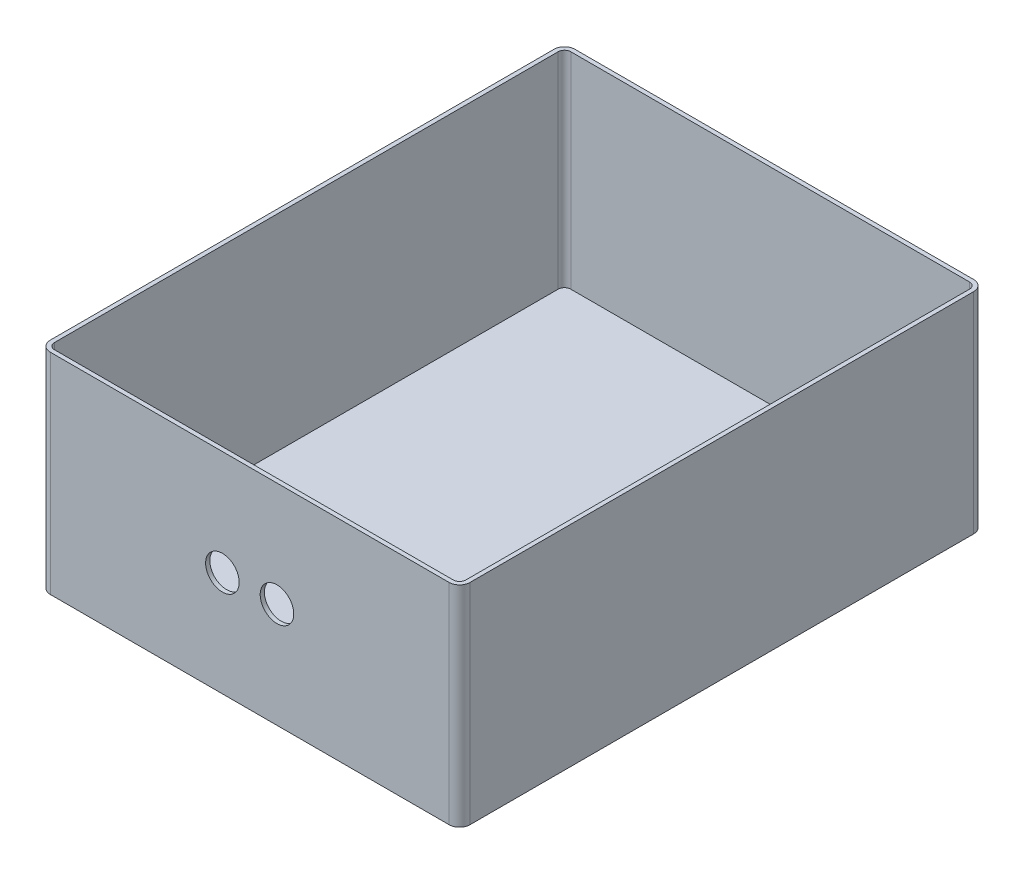
ISO-10303-21;
HEADER;
FILE_DESCRIPTION(('STEP AP214'),'2;1');
FILE_NAME('part.step','',(''),(''),'','','');
FILE_SCHEMA(('AUTOMOTIVE_DESIGN { 1 0 10303 214 1 1 1 1 }'));
ENDSEC;
DATA;
#1=APPLICATION_CONTEXT('core data for automotive mechanical design processes');
#2=APPLICATION_PROTOCOL_DEFINITION('international standard','automotive_design',2000,#1);
#3=PRODUCT_CONTEXT('',#1,'mechanical');
#4=PRODUCT('Part','Part','',(#3));
#5=PRODUCT_RELATED_PRODUCT_CATEGORY('part','',(#4));
#6=PRODUCT_DEFINITION_FORMATION('','',#4);
#7=PRODUCT_DEFINITION_CONTEXT('part definition',#1,'design');
#8=PRODUCT_DEFINITION('design','',#6,#7);
#9=PRODUCT_DEFINITION_SHAPE('','',#8);
#10=(LENGTH_UNIT() NAMED_UNIT(*) SI_UNIT(.MILLI.,.METRE.));
#11=(NAMED_UNIT(*) PLANE_ANGLE_UNIT() SI_UNIT($,.RADIAN.));
#12=(NAMED_UNIT(*) SI_UNIT($,.STERADIAN.) SOLID_ANGLE_UNIT());
#13=UNCERTAINTY_MEASURE_WITH_UNIT(LENGTH_MEASURE(1.E-05),#10,'distance_accuracy_value','');
#14=(GEOMETRIC_REPRESENTATION_CONTEXT(3) GLOBAL_UNCERTAINTY_ASSIGNED_CONTEXT((#13)) GLOBAL_UNIT_ASSIGNED_CONTEXT((#10,
#11,#12)) REPRESENTATION_CONTEXT('',''));
#15=CARTESIAN_POINT('',(0.,0.,0.));
#16=DIRECTION('',(0.,0.,1.));
#17=DIRECTION('',(1.,0.,0.));
#18=AXIS2_PLACEMENT_3D('',#15,#16,#17);
#19=CARTESIAN_POINT('',(0.,100.,25.7956811976491));
#20=DIRECTION('',(0.,0.,-1.));
#21=DIRECTION('',(-1.,0.,0.));
#22=AXIS2_PLACEMENT_3D('',#19,#20,#21);
#23=PLANE('',#22);
#24=CARTESIAN_POINT('',(102.402855291777,50.,25.7956811976491));
#25=DIRECTION('',(0.,0.,1.));
#26=DIRECTION('',(1.,0.,0.));
#27=AXIS2_PLACEMENT_3D('',#24,#25,#26);
#28=CIRCLE('',#27,8.);
#29=CARTESIAN_POINT('',(110.402855291777,50.,25.7956811976491));
#30=VERTEX_POINT('',#29);
#31=EDGE_CURVE('E177',#30,#30,#28,.T.);
#32=ORIENTED_EDGE('',*,*,#31,.F.);
#33=EDGE_LOOP('',(#32));
#34=FACE_BOUND('',#33,.T.);
#35=CARTESIAN_POINT('',(76.4028552917766,50.,25.7956811976491));
#36=DIRECTION('',(0.,0.,1.));
#37=DIRECTION('',(1.,0.,0.));
#38=AXIS2_PLACEMENT_3D('',#35,#36,#37);
#39=CIRCLE('',#38,8.);
#40=CARTESIAN_POINT('',(84.4028552917766,50.,25.7956811976491));
#41=VERTEX_POINT('',#40);
#42=EDGE_CURVE('E183',#41,#41,#39,.T.);
#43=ORIENTED_EDGE('',*,*,#42,.F.);
#44=EDGE_LOOP('',(#43));
#45=FACE_BOUND('',#44,.T.);
#46=DIRECTION('',(1.,0.,0.));
#47=VECTOR('',#46,1.);
#48=CARTESIAN_POINT('',(0.,0.,25.7956811976491));
#49=LINE('',#48,#47);
#50=CARTESIAN_POINT('',(-5.59714470822342,0.,25.7956811976491));
#51=VERTEX_POINT('',#50);
#52=CARTESIAN_POINT('',(184.402855291777,0.,25.7956811976491));
#53=VERTEX_POINT('',#52);
#54=EDGE_CURVE('E147',#51,#53,#49,.T.);
#55=ORIENTED_EDGE('',*,*,#54,.T.);
#56=DIRECTION('',(0.,-1.,0.));
#57=VECTOR('',#56,1.);
#58=CARTESIAN_POINT('',(184.402855291777,100.,25.7956811976491));
#59=LINE('',#58,#57);
#60=CARTESIAN_POINT('',(184.402855291777,100.,25.7956811976491));
#61=VERTEX_POINT('',#60);
#62=EDGE_CURVE('E11',#61,#53,#59,.T.);
#63=ORIENTED_EDGE('',*,*,#62,.F.);
#64=DIRECTION('',(1.,0.,0.));
#65=VECTOR('',#64,1.);
#66=CARTESIAN_POINT('',(0.,100.,25.7956811976491));
#67=LINE('',#66,#65);
#68=CARTESIAN_POINT('',(-5.59714470822342,100.,25.7956811976491));
#69=VERTEX_POINT('',#68);
#70=EDGE_CURVE('E167',#69,#61,#67,.T.);
#71=ORIENTED_EDGE('',*,*,#70,.F.);
#72=DIRECTION('',(0.,-1.,0.));
#73=VECTOR('',#72,1.);
#74=CARTESIAN_POINT('',(-5.59714470822342,100.,25.7956811976491));
#75=LINE('',#74,#73);
#76=EDGE_CURVE('E143',#69,#51,#75,.T.);
#77=ORIENTED_EDGE('',*,*,#76,.T.);
#78=EDGE_LOOP('',(#55,#63,#71,#77));
#79=FACE_BOUND('',#78,.T.);
#80=ADVANCED_FACE('F39',(#34,#45,#79),#23,.F.);
#81=CARTESIAN_POINT('',(184.402855291777,100.,20.7956811976491));
#82=DIRECTION('',(0.,-1.,0.));
#83=DIRECTION('',(0.,0.,-1.));
#84=AXIS2_PLACEMENT_3D('',#81,#82,#83);
#85=CYLINDRICAL_SURFACE('',#84,5.);
#86=CARTESIAN_POINT('',(184.402855291777,0.,20.7956811976491));
#87=DIRECTION('',(0.,1.,0.));
#88=DIRECTION('',(0.,0.,1.));
#89=AXIS2_PLACEMENT_3D('',#86,#87,#88);
#90=CIRCLE('',#89,5.);
#91=CARTESIAN_POINT('',(189.402855291777,0.,20.7956811976491));
#92=VERTEX_POINT('',#91);
#93=EDGE_CURVE('E150',#53,#92,#90,.T.);
#94=ORIENTED_EDGE('',*,*,#93,.T.);
#95=DIRECTION('',(0.,-1.,0.));
#96=VECTOR('',#95,1.);
#97=CARTESIAN_POINT('',(189.402855291777,100.,20.7956811976491));
#98=LINE('',#97,#96);
#99=CARTESIAN_POINT('',(189.402855291777,100.,20.7956811976491));
#100=VERTEX_POINT('',#99);
#101=EDGE_CURVE('E47',#100,#92,#98,.T.);
#102=ORIENTED_EDGE('',*,*,#101,.F.);
#103=CARTESIAN_POINT('',(184.402855291777,100.,20.7956811976491));
#104=DIRECTION('',(0.,1.,0.));
#105=DIRECTION('',(0.,0.,1.));
#106=AXIS2_PLACEMENT_3D('',#103,#104,#105);
#107=CIRCLE('',#106,5.);
#108=EDGE_CURVE('E105',#61,#100,#107,.T.);
#109=ORIENTED_EDGE('',*,*,#108,.F.);
#110=ORIENTED_EDGE('',*,*,#62,.T.);
#111=EDGE_LOOP('',(#94,#102,#109,#110));
#112=FACE_BOUND('',#111,.T.);
#113=ADVANCED_FACE('F275',(#112),#85,.T.);
#114=CARTESIAN_POINT('',(189.402855291777,100.,0.));
#115=DIRECTION('',(1.,0.,0.));
#116=DIRECTION('',(0.,0.,-1.));
#117=AXIS2_PLACEMENT_3D('',#114,#115,#116);
#118=PLANE('',#117);
#119=DIRECTION('',(0.,0.,1.));
#120=VECTOR('',#119,1.);
#121=CARTESIAN_POINT('',(189.402855291777,0.,0.));
#122=LINE('',#121,#120);
#123=CARTESIAN_POINT('',(189.402855291777,0.,-219.204318802351));
#124=VERTEX_POINT('',#123);
#125=EDGE_CURVE('E154',#124,#92,#122,.T.);
#126=ORIENTED_EDGE('',*,*,#125,.F.);
#127=DIRECTION('',(0.,-1.,0.));
#128=VECTOR('',#127,1.);
#129=CARTESIAN_POINT('',(189.402855291777,100.,-219.204318802351));
#130=LINE('',#129,#128);
#131=CARTESIAN_POINT('',(189.402855291777,100.,-219.204318802351));
#132=VERTEX_POINT('',#131);
#133=EDGE_CURVE('E173',#132,#124,#130,.T.);
#134=ORIENTED_EDGE('',*,*,#133,.F.);
#135=DIRECTION('',(0.,0.,1.));
#136=VECTOR('',#135,1.);
#137=CARTESIAN_POINT('',(189.402855291777,100.,0.));
#138=LINE('',#137,#136);
#139=EDGE_CURVE('E258',#132,#100,#138,.T.);
#140=ORIENTED_EDGE('',*,*,#139,.T.);
#141=ORIENTED_EDGE('',*,*,#101,.T.);
#142=EDGE_LOOP('',(#126,#134,#140,#141));
#143=FACE_BOUND('',#142,.T.);
#144=ADVANCED_FACE('F278',(#143),#118,.T.);
#145=CARTESIAN_POINT('',(184.402855291777,100.,-219.204318802351));
#146=DIRECTION('',(0.,-1.,0.));
#147=DIRECTION('',(0.,0.,-1.));
#148=AXIS2_PLACEMENT_3D('',#145,#146,#147);
#149=CYLINDRICAL_SURFACE('',#148,4.99999999999999);
#150=CARTESIAN_POINT('',(184.402855291777,0.,-219.204318802351));
#151=DIRECTION('',(0.,1.,0.));
#152=DIRECTION('',(0.,0.,1.));
#153=AXIS2_PLACEMENT_3D('',#150,#151,#152);
#154=CIRCLE('',#153,4.99999999999999);
#155=CARTESIAN_POINT('',(184.402855291777,0.,-224.204318802351));
#156=VERTEX_POINT('',#155);
#157=EDGE_CURVE('E157',#124,#156,#154,.T.);
#158=ORIENTED_EDGE('',*,*,#157,.T.);
#159=DIRECTION('',(0.,-1.,0.));
#160=VECTOR('',#159,1.);
#161=CARTESIAN_POINT('',(184.402855291777,100.,-224.204318802351));
#162=LINE('',#161,#160);
#163=CARTESIAN_POINT('',(184.402855291777,100.,-224.204318802351));
#164=VERTEX_POINT('',#163);
#165=EDGE_CURVE('E171',#164,#156,#162,.T.);
#166=ORIENTED_EDGE('',*,*,#165,.F.);
#167=CARTESIAN_POINT('',(184.402855291777,100.,-219.204318802351));
#168=DIRECTION('',(0.,1.,0.));
#169=DIRECTION('',(0.,0.,1.));
#170=AXIS2_PLACEMENT_3D('',#167,#168,#169);
#171=CIRCLE('',#170,4.99999999999999);
#172=EDGE_CURVE('E261',#132,#164,#171,.T.);
#173=ORIENTED_EDGE('',*,*,#172,.F.);
#174=ORIENTED_EDGE('',*,*,#133,.T.);
#175=EDGE_LOOP('',(#158,#166,#173,#174));
#176=FACE_BOUND('',#175,.T.);
#177=ADVANCED_FACE('F281',(#176),#149,.T.);
#178=CARTESIAN_POINT('',(0.,100.,-224.204318802351));
#179=DIRECTION('',(0.,0.,-1.));
#180=DIRECTION('',(-1.,0.,0.));
#181=AXIS2_PLACEMENT_3D('',#178,#179,#180);
#182=PLANE('',#181);
#183=DIRECTION('',(1.,0.,0.));
#184=VECTOR('',#183,1.);
#185=CARTESIAN_POINT('',(0.,0.,-224.204318802351));
#186=LINE('',#185,#184);
#187=CARTESIAN_POINT('',(-5.59714470822345,0.,-224.204318802351));
#188=VERTEX_POINT('',#187);
#189=EDGE_CURVE('E160',#188,#156,#186,.T.);
#190=ORIENTED_EDGE('',*,*,#189,.F.);
#191=DIRECTION('',(0.,-1.,0.));
#192=VECTOR('',#191,1.);
#193=CARTESIAN_POINT('',(-5.59714470822345,100.,-224.204318802351));
#194=LINE('',#193,#192);
#195=CARTESIAN_POINT('',(-5.59714470822345,100.,-224.204318802351));
#196=VERTEX_POINT('',#195);
#197=EDGE_CURVE('E138',#196,#188,#194,.T.);
#198=ORIENTED_EDGE('',*,*,#197,.F.);
#199=DIRECTION('',(1.,0.,0.));
#200=VECTOR('',#199,1.);
#201=CARTESIAN_POINT('',(0.,100.,-224.204318802351));
#202=LINE('',#201,#200);
#203=EDGE_CURVE('E128',#196,#164,#202,.T.);
#204=ORIENTED_EDGE('',*,*,#203,.T.);
#205=ORIENTED_EDGE('',*,*,#165,.T.);
#206=EDGE_LOOP('',(#190,#198,#204,#205));
#207=FACE_BOUND('',#206,.T.);
#208=ADVANCED_FACE('F264',(#207),#182,.T.);
#209=CARTESIAN_POINT('',(-5.59714470822344,100.,-219.204318802351));
#210=DIRECTION('',(0.,-1.,0.));
#211=DIRECTION('',(0.,0.,-1.));
#212=AXIS2_PLACEMENT_3D('',#209,#210,#211);
#213=CYLINDRICAL_SURFACE('',#212,5.00000000000001);
#214=CARTESIAN_POINT('',(-5.59714470822344,0.,-219.204318802351));
#215=DIRECTION('',(0.,1.,0.));
#216=DIRECTION('',(0.,0.,1.));
#217=AXIS2_PLACEMENT_3D('',#214,#215,#216);
#218=CIRCLE('',#217,5.00000000000001);
#219=CARTESIAN_POINT('',(-10.5971447082235,0.,-219.204318802351));
#220=VERTEX_POINT('',#219);
#221=EDGE_CURVE('E135',#188,#220,#218,.T.);
#222=ORIENTED_EDGE('',*,*,#221,.T.);
#223=DIRECTION('',(0.,-1.,0.));
#224=VECTOR('',#223,1.);
#225=CARTESIAN_POINT('',(-10.5971447082235,100.,-219.204318802351));
#226=LINE('',#225,#224);
#227=CARTESIAN_POINT('',(-10.5971447082235,100.,-219.204318802351));
#228=VERTEX_POINT('',#227);
#229=EDGE_CURVE('E132',#228,#220,#226,.T.);
#230=ORIENTED_EDGE('',*,*,#229,.F.);
#231=CARTESIAN_POINT('',(-5.59714470822344,100.,-219.204318802351));
#232=DIRECTION('',(0.,1.,0.));
#233=DIRECTION('',(0.,0.,1.));
#234=AXIS2_PLACEMENT_3D('',#231,#232,#233);
#235=CIRCLE('',#234,5.00000000000001);
#236=EDGE_CURVE('E121',#196,#228,#235,.T.);
#237=ORIENTED_EDGE('',*,*,#236,.F.);
#238=ORIENTED_EDGE('',*,*,#197,.T.);
#239=EDGE_LOOP('',(#222,#230,#237,#238));
#240=FACE_BOUND('',#239,.T.);
#241=ADVANCED_FACE('F133',(#240),#213,.T.);
#242=CARTESIAN_POINT('',(-10.5971447082234,100.,0.));
#243=DIRECTION('',(1.,0.,0.));
#244=DIRECTION('',(0.,0.,-1.));
#245=AXIS2_PLACEMENT_3D('',#242,#243,#244);
#246=PLANE('',#245);
#247=DIRECTION('',(0.,0.,1.));
#248=VECTOR('',#247,1.);
#249=CARTESIAN_POINT('',(-10.5971447082234,0.,0.));
#250=LINE('',#249,#248);
#251=CARTESIAN_POINT('',(-10.5971447082234,0.,20.7956811976491));
#252=VERTEX_POINT('',#251);
#253=EDGE_CURVE('E164',#220,#252,#250,.T.);
#254=ORIENTED_EDGE('',*,*,#253,.T.);
#255=DIRECTION('',(0.,-1.,0.));
#256=VECTOR('',#255,1.);
#257=CARTESIAN_POINT('',(-10.5971447082234,100.,20.7956811976491));
#258=LINE('',#257,#256);
#259=CARTESIAN_POINT('',(-10.5971447082234,100.,20.7956811976491));
#260=VERTEX_POINT('',#259);
#261=EDGE_CURVE('E139',#260,#252,#258,.T.);
#262=ORIENTED_EDGE('',*,*,#261,.F.);
#263=DIRECTION('',(0.,0.,1.));
#264=VECTOR('',#263,1.);
#265=CARTESIAN_POINT('',(-10.5971447082234,100.,0.));
#266=LINE('',#265,#264);
#267=EDGE_CURVE('E125',#228,#260,#266,.T.);
#268=ORIENTED_EDGE('',*,*,#267,.F.);
#269=ORIENTED_EDGE('',*,*,#229,.T.);
#270=EDGE_LOOP('',(#254,#262,#268,#269));
#271=FACE_BOUND('',#270,.T.);
#272=ADVANCED_FACE('F141',(#271),#246,.F.);
#273=CARTESIAN_POINT('',(-5.59714470822342,100.,20.7956811976491));
#274=DIRECTION('',(0.,-1.,0.));
#275=DIRECTION('',(0.,0.,-1.));
#276=AXIS2_PLACEMENT_3D('',#273,#274,#275);
#277=CYLINDRICAL_SURFACE('',#276,5.);
#278=CARTESIAN_POINT('',(-5.59714470822342,0.,20.7956811976491));
#279=DIRECTION('',(0.,1.,0.));
#280=DIRECTION('',(0.,0.,1.));
#281=AXIS2_PLACEMENT_3D('',#278,#279,#280);
#282=CIRCLE('',#281,5.);
#283=EDGE_CURVE('E97',#252,#51,#282,.T.);
#284=ORIENTED_EDGE('',*,*,#283,.T.);
#285=ORIENTED_EDGE('',*,*,#76,.F.);
#286=CARTESIAN_POINT('',(-5.59714470822342,100.,20.7956811976491));
#287=DIRECTION('',(0.,1.,0.));
#288=DIRECTION('',(0.,0.,1.));
#289=AXIS2_PLACEMENT_3D('',#286,#287,#288);
#290=CIRCLE('',#289,5.);
#291=EDGE_CURVE('E64',#260,#69,#290,.T.);
#292=ORIENTED_EDGE('',*,*,#291,.F.);
#293=ORIENTED_EDGE('',*,*,#261,.T.);
#294=EDGE_LOOP('',(#284,#285,#292,#293));
#295=FACE_BOUND('',#294,.T.);
#296=ADVANCED_FACE('F270',(#295),#277,.T.);
#297=CARTESIAN_POINT('',(0.,100.,0.));
#298=DIRECTION('',(0.,1.,0.));
#299=DIRECTION('',(0.,0.,1.));
#300=AXIS2_PLACEMENT_3D('',#297,#298,#299);
#301=PLANE('',#300);
#302=DIRECTION('',(1.,0.,0.));
#303=VECTOR('',#302,1.);
#304=CARTESIAN_POINT('',(0.,100.,23.7956811976491));
#305=LINE('',#304,#303);
#306=CARTESIAN_POINT('',(-5.59714470822342,100.,23.7956811976491));
#307=VERTEX_POINT('',#306);
#308=CARTESIAN_POINT('',(184.402855291777,100.,23.7956811976491));
#309=VERTEX_POINT('',#308);
#310=EDGE_CURVE('E235',#307,#309,#305,.T.);
#311=ORIENTED_EDGE('',*,*,#310,.F.);
#312=CARTESIAN_POINT('',(-5.59714470822342,100.,20.7956811976491));
#313=DIRECTION('',(0.,1.,0.));
#314=DIRECTION('',(0.,0.,1.));
#315=AXIS2_PLACEMENT_3D('',#312,#313,#314);
#316=CIRCLE('',#315,3.);
#317=CARTESIAN_POINT('',(-8.59714470822343,100.,20.7956811976491));
#318=VERTEX_POINT('',#317);
#319=EDGE_CURVE('E199',#318,#307,#316,.T.);
#320=ORIENTED_EDGE('',*,*,#319,.F.);
#321=DIRECTION('',(0.,0.,1.));
#322=VECTOR('',#321,1.);
#323=CARTESIAN_POINT('',(-8.59714470822343,100.,0.));
#324=LINE('',#323,#322);
#325=CARTESIAN_POINT('',(-8.59714470822345,100.,-219.204318802351));
#326=VERTEX_POINT('',#325);
#327=EDGE_CURVE('E253',#326,#318,#324,.T.);
#328=ORIENTED_EDGE('',*,*,#327,.F.);
#329=CARTESIAN_POINT('',(-5.59714470822344,100.,-219.204318802351));
#330=DIRECTION('',(0.,1.,0.));
#331=DIRECTION('',(0.,0.,1.));
#332=AXIS2_PLACEMENT_3D('',#329,#330,#331);
#333=CIRCLE('',#332,3.00000000000001);
#334=CARTESIAN_POINT('',(-5.59714470822345,100.,-222.204318802351));
#335=VERTEX_POINT('',#334);
#336=EDGE_CURVE('E250',#335,#326,#333,.T.);
#337=ORIENTED_EDGE('',*,*,#336,.F.);
#338=DIRECTION('',(1.,0.,0.));
#339=VECTOR('',#338,1.);
#340=CARTESIAN_POINT('',(0.,100.,-222.204318802351));
#341=LINE('',#340,#339);
#342=CARTESIAN_POINT('',(184.402855291777,100.,-222.204318802351));
#343=VERTEX_POINT('',#342);
#344=EDGE_CURVE('E247',#335,#343,#341,.T.);
#345=ORIENTED_EDGE('',*,*,#344,.T.);
#346=CARTESIAN_POINT('',(184.402855291777,100.,-219.204318802351));
#347=DIRECTION('',(0.,1.,0.));
#348=DIRECTION('',(0.,0.,1.));
#349=AXIS2_PLACEMENT_3D('',#346,#347,#348);
#350=CIRCLE('',#349,2.99999999999999);
#351=CARTESIAN_POINT('',(187.402855291777,100.,-219.204318802351));
#352=VERTEX_POINT('',#351);
#353=EDGE_CURVE('E244',#352,#343,#350,.T.);
#354=ORIENTED_EDGE('',*,*,#353,.F.);
#355=DIRECTION('',(0.,0.,1.));
#356=VECTOR('',#355,1.);
#357=CARTESIAN_POINT('',(187.402855291777,100.,0.));
#358=LINE('',#357,#356);
#359=CARTESIAN_POINT('',(187.402855291777,100.,20.7956811976491));
#360=VERTEX_POINT('',#359);
#361=EDGE_CURVE('E241',#352,#360,#358,.T.);
#362=ORIENTED_EDGE('',*,*,#361,.T.);
#363=CARTESIAN_POINT('',(184.402855291777,100.,20.7956811976491));
#364=DIRECTION('',(0.,1.,0.));
#365=DIRECTION('',(0.,0.,1.));
#366=AXIS2_PLACEMENT_3D('',#363,#364,#365);
#367=CIRCLE('',#366,3.);
#368=EDGE_CURVE('E238',#309,#360,#367,.T.);
#369=ORIENTED_EDGE('',*,*,#368,.F.);
#370=EDGE_LOOP('',(#311,#320,#328,#337,#345,#354,#362,#369));
#371=FACE_BOUND('',#370,.T.);
#372=ORIENTED_EDGE('',*,*,#70,.T.);
#373=ORIENTED_EDGE('',*,*,#108,.T.);
#374=ORIENTED_EDGE('',*,*,#139,.F.);
#375=ORIENTED_EDGE('',*,*,#172,.T.);
#376=ORIENTED_EDGE('',*,*,#203,.F.);
#377=ORIENTED_EDGE('',*,*,#236,.T.);
#378=ORIENTED_EDGE('',*,*,#267,.T.);
#379=ORIENTED_EDGE('',*,*,#291,.T.);
#380=EDGE_LOOP('',(#372,#373,#374,#375,#376,#377,#378,#379));
#381=FACE_BOUND('',#380,.T.);
#382=ADVANCED_FACE('F123',(#371,#381),#301,.T.);
#383=CARTESIAN_POINT('',(0.,0.,0.));
#384=DIRECTION('',(0.,1.,0.));
#385=DIRECTION('',(0.,0.,1.));
#386=AXIS2_PLACEMENT_3D('',#383,#384,#385);
#387=PLANE('',#386);
#388=ORIENTED_EDGE('',*,*,#54,.F.);
#389=ORIENTED_EDGE('',*,*,#283,.F.);
#390=ORIENTED_EDGE('',*,*,#253,.F.);
#391=ORIENTED_EDGE('',*,*,#221,.F.);
#392=ORIENTED_EDGE('',*,*,#189,.T.);
#393=ORIENTED_EDGE('',*,*,#157,.F.);
#394=ORIENTED_EDGE('',*,*,#125,.T.);
#395=ORIENTED_EDGE('',*,*,#93,.F.);
#396=EDGE_LOOP('',(#388,#389,#390,#391,#392,#393,#394,#395));
#397=FACE_BOUND('',#396,.T.);
#398=ADVANCED_FACE('F268',(#397),#387,.F.);
#399=CARTESIAN_POINT('',(0.,100.,23.7956811976491));
#400=DIRECTION('',(0.,0.,-1.));
#401=DIRECTION('',(-1.,0.,0.));
#402=AXIS2_PLACEMENT_3D('',#399,#400,#401);
#403=PLANE('',#402);
#404=CARTESIAN_POINT('',(102.402855291777,50.,23.7956811976491));
#405=DIRECTION('',(0.,0.,-1.));
#406=DIRECTION('',(-1.,0.,0.));
#407=AXIS2_PLACEMENT_3D('',#404,#405,#406);
#408=CIRCLE('',#407,8.);
#409=CARTESIAN_POINT('',(94.4028552917766,50.,23.7956811976491));
#410=VERTEX_POINT('',#409);
#411=EDGE_CURVE('E42',#410,#410,#408,.T.);
#412=ORIENTED_EDGE('',*,*,#411,.F.);
#413=EDGE_LOOP('',(#412));
#414=FACE_BOUND('',#413,.T.);
#415=CARTESIAN_POINT('',(76.4028552917766,50.,23.7956811976491));
#416=DIRECTION('',(0.,0.,-1.));
#417=DIRECTION('',(-1.,0.,0.));
#418=AXIS2_PLACEMENT_3D('',#415,#416,#417);
#419=CIRCLE('',#418,8.);
#420=CARTESIAN_POINT('',(68.4028552917766,50.,23.7956811976491));
#421=VERTEX_POINT('',#420);
#422=EDGE_CURVE('E175',#421,#421,#419,.T.);
#423=ORIENTED_EDGE('',*,*,#422,.F.);
#424=EDGE_LOOP('',(#423));
#425=FACE_BOUND('',#424,.T.);
#426=DIRECTION('',(1.,0.,0.));
#427=VECTOR('',#426,1.);
#428=CARTESIAN_POINT('',(0.,2.,23.7956811976491));
#429=LINE('',#428,#427);
#430=CARTESIAN_POINT('',(-5.59714470822342,2.,23.7956811976491));
#431=VERTEX_POINT('',#430);
#432=CARTESIAN_POINT('',(184.402855291777,2.,23.7956811976491));
#433=VERTEX_POINT('',#432);
#434=EDGE_CURVE('E181',#431,#433,#429,.T.);
#435=ORIENTED_EDGE('',*,*,#434,.F.);
#436=DIRECTION('',(0.,1.,0.));
#437=VECTOR('',#436,1.);
#438=CARTESIAN_POINT('',(-5.59714470822342,100.,23.7956811976491));
#439=LINE('',#438,#437);
#440=EDGE_CURVE('E196',#307,#431,#439,.F.);
#441=ORIENTED_EDGE('',*,*,#440,.F.);
#442=ORIENTED_EDGE('',*,*,#310,.T.);
#443=DIRECTION('',(0.,-1.,0.));
#444=VECTOR('',#443,1.);
#445=CARTESIAN_POINT('',(184.402855291777,100.,23.7956811976491));
#446=LINE('',#445,#444);
#447=EDGE_CURVE('E151',#309,#433,#446,.T.);
#448=ORIENTED_EDGE('',*,*,#447,.T.);
#449=EDGE_LOOP('',(#435,#441,#442,#448));
#450=FACE_BOUND('',#449,.T.);
#451=ADVANCED_FACE('F313',(#414,#425,#450),#403,.T.);
#452=CARTESIAN_POINT('',(184.402855291777,100.,20.7956811976491));
#453=DIRECTION('',(0.,-1.,0.));
#454=DIRECTION('',(0.,0.,-1.));
#455=AXIS2_PLACEMENT_3D('',#452,#453,#454);
#456=CYLINDRICAL_SURFACE('',#455,3.);
#457=CARTESIAN_POINT('',(184.402855291777,2.,20.7956811976491));
#458=DIRECTION('',(0.,1.,0.));
#459=DIRECTION('',(0.,0.,1.));
#460=AXIS2_PLACEMENT_3D('',#457,#458,#459);
#461=CIRCLE('',#460,3.);
#462=CARTESIAN_POINT('',(187.402855291777,2.,20.7956811976491));
#463=VERTEX_POINT('',#462);
#464=EDGE_CURVE('E192',#433,#463,#461,.T.);
#465=ORIENTED_EDGE('',*,*,#464,.F.);
#466=ORIENTED_EDGE('',*,*,#447,.F.);
#467=ORIENTED_EDGE('',*,*,#368,.T.);
#468=DIRECTION('',(0.,1.,0.));
#469=VECTOR('',#468,1.);
#470=CARTESIAN_POINT('',(187.402855291777,100.,20.7956811976491));
#471=LINE('',#470,#469);
#472=EDGE_CURVE('E195',#360,#463,#471,.F.);
#473=ORIENTED_EDGE('',*,*,#472,.T.);
#474=EDGE_LOOP('',(#465,#466,#467,#473));
#475=FACE_BOUND('',#474,.T.);
#476=ADVANCED_FACE('F316',(#475),#456,.F.);
#477=CARTESIAN_POINT('',(187.402855291777,100.,0.));
#478=DIRECTION('',(1.,0.,0.));
#479=DIRECTION('',(0.,0.,-1.));
#480=AXIS2_PLACEMENT_3D('',#477,#478,#479);
#481=PLANE('',#480);
#482=DIRECTION('',(0.,0.,1.));
#483=VECTOR('',#482,1.);
#484=CARTESIAN_POINT('',(187.402855291777,2.,0.));
#485=LINE('',#484,#483);
#486=CARTESIAN_POINT('',(187.402855291777,2.,-219.204318802351));
#487=VERTEX_POINT('',#486);
#488=EDGE_CURVE('E202',#487,#463,#485,.T.);
#489=ORIENTED_EDGE('',*,*,#488,.T.);
#490=ORIENTED_EDGE('',*,*,#472,.F.);
#491=ORIENTED_EDGE('',*,*,#361,.F.);
#492=DIRECTION('',(0.,-1.,0.));
#493=VECTOR('',#492,1.);
#494=CARTESIAN_POINT('',(187.402855291777,100.,-219.204318802351));
#495=LINE('',#494,#493);
#496=EDGE_CURVE('E205',#352,#487,#495,.T.);
#497=ORIENTED_EDGE('',*,*,#496,.T.);
#498=EDGE_LOOP('',(#489,#490,#491,#497));
#499=FACE_BOUND('',#498,.T.);
#500=ADVANCED_FACE('F320',(#499),#481,.F.);
#501=CARTESIAN_POINT('',(184.402855291777,100.,-219.204318802351));
#502=DIRECTION('',(0.,-1.,0.));
#503=DIRECTION('',(0.,0.,-1.));
#504=AXIS2_PLACEMENT_3D('',#501,#502,#503);
#505=CYLINDRICAL_SURFACE('',#504,2.99999999999999);
#506=CARTESIAN_POINT('',(184.402855291777,2.,-219.204318802351));
#507=DIRECTION('',(0.,1.,0.));
#508=DIRECTION('',(0.,0.,1.));
#509=AXIS2_PLACEMENT_3D('',#506,#507,#508);
#510=CIRCLE('',#509,2.99999999999999);
#511=CARTESIAN_POINT('',(184.402855291777,2.,-222.204318802351));
#512=VERTEX_POINT('',#511);
#513=EDGE_CURVE('E208',#487,#512,#510,.T.);
#514=ORIENTED_EDGE('',*,*,#513,.F.);
#515=ORIENTED_EDGE('',*,*,#496,.F.);
#516=ORIENTED_EDGE('',*,*,#353,.T.);
#517=DIRECTION('',(0.,1.,0.));
#518=VECTOR('',#517,1.);
#519=CARTESIAN_POINT('',(184.402855291777,100.,-222.204318802351));
#520=LINE('',#519,#518);
#521=EDGE_CURVE('E211',#343,#512,#520,.F.);
#522=ORIENTED_EDGE('',*,*,#521,.T.);
#523=EDGE_LOOP('',(#514,#515,#516,#522));
#524=FACE_BOUND('',#523,.T.);
#525=ADVANCED_FACE('F324',(#524),#505,.F.);
#526=CARTESIAN_POINT('',(0.,100.,-222.204318802351));
#527=DIRECTION('',(0.,0.,-1.));
#528=DIRECTION('',(-1.,0.,0.));
#529=AXIS2_PLACEMENT_3D('',#526,#527,#528);
#530=PLANE('',#529);
#531=DIRECTION('',(1.,0.,0.));
#532=VECTOR('',#531,1.);
#533=CARTESIAN_POINT('',(0.,2.,-222.204318802351));
#534=LINE('',#533,#532);
#535=CARTESIAN_POINT('',(-5.59714470822345,2.,-222.204318802351));
#536=VERTEX_POINT('',#535);
#537=EDGE_CURVE('E214',#536,#512,#534,.T.);
#538=ORIENTED_EDGE('',*,*,#537,.T.);
#539=ORIENTED_EDGE('',*,*,#521,.F.);
#540=ORIENTED_EDGE('',*,*,#344,.F.);
#541=DIRECTION('',(0.,-1.,0.));
#542=VECTOR('',#541,1.);
#543=CARTESIAN_POINT('',(-5.59714470822345,100.,-222.204318802351));
#544=LINE('',#543,#542);
#545=EDGE_CURVE('E217',#335,#536,#544,.T.);
#546=ORIENTED_EDGE('',*,*,#545,.T.);
#547=EDGE_LOOP('',(#538,#539,#540,#546));
#548=FACE_BOUND('',#547,.T.);
#549=ADVANCED_FACE('F328',(#548),#530,.F.);
#550=CARTESIAN_POINT('',(-5.59714470822344,100.,-219.204318802351));
#551=DIRECTION('',(0.,-1.,0.));
#552=DIRECTION('',(0.,0.,-1.));
#553=AXIS2_PLACEMENT_3D('',#550,#551,#552);
#554=CYLINDRICAL_SURFACE('',#553,3.00000000000001);
#555=CARTESIAN_POINT('',(-5.59714470822344,2.,-219.204318802351));
#556=DIRECTION('',(0.,1.,0.));
#557=DIRECTION('',(0.,0.,1.));
#558=AXIS2_PLACEMENT_3D('',#555,#556,#557);
#559=CIRCLE('',#558,3.00000000000001);
#560=CARTESIAN_POINT('',(-8.59714470822346,2.,-219.204318802351));
#561=VERTEX_POINT('',#560);
#562=EDGE_CURVE('E220',#536,#561,#559,.T.);
#563=ORIENTED_EDGE('',*,*,#562,.F.);
#564=ORIENTED_EDGE('',*,*,#545,.F.);
#565=ORIENTED_EDGE('',*,*,#336,.T.);
#566=DIRECTION('',(0.,1.,0.));
#567=VECTOR('',#566,1.);
#568=CARTESIAN_POINT('',(-8.59714470822346,100.,-219.204318802351));
#569=LINE('',#568,#567);
#570=EDGE_CURVE('E223',#326,#561,#569,.F.);
#571=ORIENTED_EDGE('',*,*,#570,.T.);
#572=EDGE_LOOP('',(#563,#564,#565,#571));
#573=FACE_BOUND('',#572,.T.);
#574=ADVANCED_FACE('F332',(#573),#554,.F.);
#575=CARTESIAN_POINT('',(-8.59714470822343,100.,0.));
#576=DIRECTION('',(1.,0.,0.));
#577=DIRECTION('',(0.,0.,-1.));
#578=AXIS2_PLACEMENT_3D('',#575,#576,#577);
#579=PLANE('',#578);
#580=DIRECTION('',(0.,0.,1.));
#581=VECTOR('',#580,1.);
#582=CARTESIAN_POINT('',(-8.59714470822343,2.,0.));
#583=LINE('',#582,#581);
#584=CARTESIAN_POINT('',(-8.59714470822343,2.,20.7956811976491));
#585=VERTEX_POINT('',#584);
#586=EDGE_CURVE('E226',#561,#585,#583,.T.);
#587=ORIENTED_EDGE('',*,*,#586,.F.);
#588=ORIENTED_EDGE('',*,*,#570,.F.);
#589=ORIENTED_EDGE('',*,*,#327,.T.);
#590=DIRECTION('',(0.,-1.,0.));
#591=VECTOR('',#590,1.);
#592=CARTESIAN_POINT('',(-8.59714470822343,100.,20.7956811976491));
#593=LINE('',#592,#591);
#594=EDGE_CURVE('E55',#318,#585,#593,.T.);
#595=ORIENTED_EDGE('',*,*,#594,.T.);
#596=EDGE_LOOP('',(#587,#588,#589,#595));
#597=FACE_BOUND('',#596,.T.);
#598=ADVANCED_FACE('F336',(#597),#579,.T.);
#599=CARTESIAN_POINT('',(-5.59714470822342,100.,20.7956811976491));
#600=DIRECTION('',(0.,-1.,0.));
#601=DIRECTION('',(0.,0.,-1.));
#602=AXIS2_PLACEMENT_3D('',#599,#600,#601);
#603=CYLINDRICAL_SURFACE('',#602,3.);
#604=CARTESIAN_POINT('',(-5.59714470822342,2.,20.7956811976491));
#605=DIRECTION('',(0.,1.,0.));
#606=DIRECTION('',(0.,0.,1.));
#607=AXIS2_PLACEMENT_3D('',#604,#605,#606);
#608=CIRCLE('',#607,3.);
#609=EDGE_CURVE('E231',#585,#431,#608,.T.);
#610=ORIENTED_EDGE('',*,*,#609,.F.);
#611=ORIENTED_EDGE('',*,*,#594,.F.);
#612=ORIENTED_EDGE('',*,*,#319,.T.);
#613=ORIENTED_EDGE('',*,*,#440,.T.);
#614=EDGE_LOOP('',(#610,#611,#612,#613));
#615=FACE_BOUND('',#614,.T.);
#616=ADVANCED_FACE('F309',(#615),#603,.F.);
#617=CARTESIAN_POINT('',(0.,2.,0.));
#618=DIRECTION('',(0.,1.,0.));
#619=DIRECTION('',(0.,0.,1.));
#620=AXIS2_PLACEMENT_3D('',#617,#618,#619);
#621=PLANE('',#620);
#622=ORIENTED_EDGE('',*,*,#434,.T.);
#623=ORIENTED_EDGE('',*,*,#464,.T.);
#624=ORIENTED_EDGE('',*,*,#488,.F.);
#625=ORIENTED_EDGE('',*,*,#513,.T.);
#626=ORIENTED_EDGE('',*,*,#537,.F.);
#627=ORIENTED_EDGE('',*,*,#562,.T.);
#628=ORIENTED_EDGE('',*,*,#586,.T.);
#629=ORIENTED_EDGE('',*,*,#609,.T.);
#630=EDGE_LOOP('',(#622,#623,#624,#625,#626,#627,#628,#629));
#631=FACE_BOUND('',#630,.T.);
#632=ADVANCED_FACE('F301',(#631),#621,.T.);
#633=CARTESIAN_POINT('',(76.4028552917766,50.,-74.2043188023509));
#634=DIRECTION('',(0.,0.,1.));
#635=DIRECTION('',(1.,0.,0.));
#636=AXIS2_PLACEMENT_3D('',#633,#634,#635);
#637=CYLINDRICAL_SURFACE('',#636,8.);
#638=ORIENTED_EDGE('',*,*,#422,.T.);
#639=EDGE_LOOP('',(#638));
#640=FACE_BOUND('',#639,.T.);
#641=ORIENTED_EDGE('',*,*,#42,.T.);
#642=EDGE_LOOP('',(#641));
#643=FACE_BOUND('',#642,.T.);
#644=ADVANCED_FACE('F298',(#640,#643),#637,.F.);
#645=CARTESIAN_POINT('',(102.402855291777,50.,-74.2043188023509));
#646=DIRECTION('',(0.,0.,1.));
#647=DIRECTION('',(1.,0.,0.));
#648=AXIS2_PLACEMENT_3D('',#645,#646,#647);
#649=CYLINDRICAL_SURFACE('',#648,8.);
#650=ORIENTED_EDGE('',*,*,#411,.T.);
#651=EDGE_LOOP('',(#650));
#652=FACE_BOUND('',#651,.T.);
#653=ORIENTED_EDGE('',*,*,#31,.T.);
#654=EDGE_LOOP('',(#653));
#655=FACE_BOUND('',#654,.T.);
#656=ADVANCED_FACE('F300',(#652,#655),#649,.F.);
#657=CLOSED_SHELL('',(#80,#113,#144,#177,#208,#241,#272,#296,#382,#398,#451,#476,#500,#525,#549,
#574,#598,#616,#632,#644,#656));
#658=MANIFOLD_SOLID_BREP('B2',#657);
#659=ADVANCED_BREP_SHAPE_REPRESENTATION('',(#18,#658),#14);
#660=SHAPE_DEFINITION_REPRESENTATION(#9,#659);
ENDSEC;
END-ISO-10303-21;
